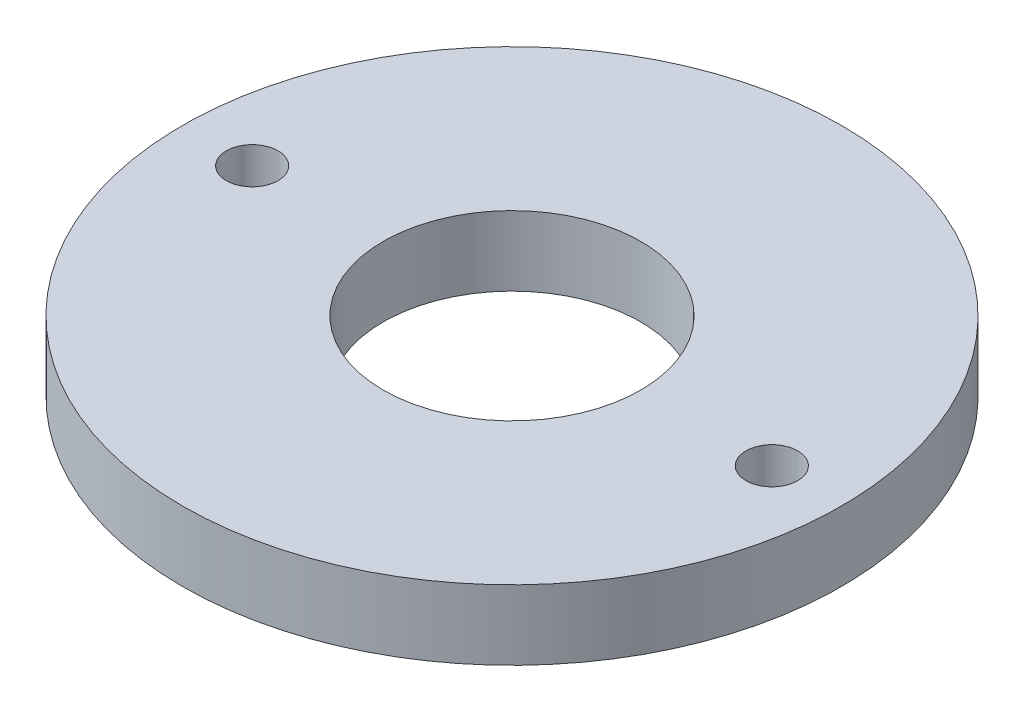
ISO-10303-21;
HEADER;
FILE_DESCRIPTION(('STEP AP214'),'2;1');
FILE_NAME('part.step','',(''),(''),'','','');
FILE_SCHEMA(('AUTOMOTIVE_DESIGN { 1 0 10303 214 1 1 1 1 }'));
ENDSEC;
DATA;
#1=APPLICATION_CONTEXT('core data for automotive mechanical design processes');
#2=APPLICATION_PROTOCOL_DEFINITION('international standard','automotive_design',2000,#1);
#3=PRODUCT_CONTEXT('',#1,'mechanical');
#4=PRODUCT('Part','Part','',(#3));
#5=PRODUCT_RELATED_PRODUCT_CATEGORY('part','',(#4));
#6=PRODUCT_DEFINITION_FORMATION('','',#4);
#7=PRODUCT_DEFINITION_CONTEXT('part definition',#1,'design');
#8=PRODUCT_DEFINITION('design','',#6,#7);
#9=PRODUCT_DEFINITION_SHAPE('','',#8);
#10=(LENGTH_UNIT() NAMED_UNIT(*) SI_UNIT(.MILLI.,.METRE.));
#11=(NAMED_UNIT(*) PLANE_ANGLE_UNIT() SI_UNIT($,.RADIAN.));
#12=(NAMED_UNIT(*) SI_UNIT($,.STERADIAN.) SOLID_ANGLE_UNIT());
#13=UNCERTAINTY_MEASURE_WITH_UNIT(LENGTH_MEASURE(1.E-05),#10,'distance_accuracy_value','');
#14=(GEOMETRIC_REPRESENTATION_CONTEXT(3) GLOBAL_UNCERTAINTY_ASSIGNED_CONTEXT((#13)) GLOBAL_UNIT_ASSIGNED_CONTEXT((#10,
#11,#12)) REPRESENTATION_CONTEXT('',''));
#15=CARTESIAN_POINT('',(0.,0.,0.));
#16=DIRECTION('',(0.,0.,1.));
#17=DIRECTION('',(1.,0.,0.));
#18=AXIS2_PLACEMENT_3D('',#15,#16,#17);
#19=CARTESIAN_POINT('',(0.,3.1,0.));
#20=DIRECTION('',(0.,1.,0.));
#21=DIRECTION('',(0.,0.,1.));
#22=AXIS2_PLACEMENT_3D('',#19,#20,#21);
#23=PLANE('',#22);
#24=CARTESIAN_POINT('',(11.55,3.1,0.));
#25=DIRECTION('',(0.,1.,0.));
#26=DIRECTION('',(0.,0.,1.));
#27=AXIS2_PLACEMENT_3D('',#24,#25,#26);
#28=CIRCLE('',#27,1.15);
#29=CARTESIAN_POINT('',(11.55,3.1,1.15));
#30=VERTEX_POINT('',#29);
#31=EDGE_CURVE('E53',#30,#30,#28,.T.);
#32=ORIENTED_EDGE('',*,*,#31,.F.);
#33=EDGE_LOOP('',(#32));
#34=FACE_BOUND('',#33,.T.);
#35=CARTESIAN_POINT('',(0.,3.1,0.));
#36=DIRECTION('',(0.,1.,0.));
#37=DIRECTION('',(0.,0.,1.));
#38=AXIS2_PLACEMENT_3D('',#35,#36,#37);
#39=CIRCLE('',#38,14.65);
#40=CARTESIAN_POINT('',(0.,3.1,14.65));
#41=VERTEX_POINT('',#40);
#42=EDGE_CURVE('E10',#41,#41,#39,.T.);
#43=ORIENTED_EDGE('',*,*,#42,.T.);
#44=EDGE_LOOP('',(#43));
#45=FACE_BOUND('',#44,.T.);
#46=CARTESIAN_POINT('',(0.,3.1,0.));
#47=DIRECTION('',(0.,1.,0.));
#48=DIRECTION('',(0.,0.,1.));
#49=AXIS2_PLACEMENT_3D('',#46,#47,#48);
#50=CIRCLE('',#49,5.725);
#51=CARTESIAN_POINT('',(0.,3.1,5.725));
#52=VERTEX_POINT('',#51);
#53=EDGE_CURVE('E48',#52,#52,#50,.T.);
#54=ORIENTED_EDGE('',*,*,#53,.F.);
#55=EDGE_LOOP('',(#54));
#56=FACE_BOUND('',#55,.T.);
#57=CARTESIAN_POINT('',(-11.55,3.1,0.));
#58=DIRECTION('',(0.,1.,0.));
#59=DIRECTION('',(0.,0.,1.));
#60=AXIS2_PLACEMENT_3D('',#57,#58,#59);
#61=CIRCLE('',#60,1.15);
#62=CARTESIAN_POINT('',(-11.55,3.1,1.15));
#63=VERTEX_POINT('',#62);
#64=EDGE_CURVE('E59',#63,#63,#61,.T.);
#65=ORIENTED_EDGE('',*,*,#64,.F.);
#66=EDGE_LOOP('',(#65));
#67=FACE_BOUND('',#66,.T.);
#68=ADVANCED_FACE('F37',(#34,#45,#56,#67),#23,.T.);
#69=CARTESIAN_POINT('',(0.,0.,0.));
#70=DIRECTION('',(0.,1.,0.));
#71=DIRECTION('',(0.,0.,1.));
#72=AXIS2_PLACEMENT_3D('',#69,#70,#71);
#73=PLANE('',#72);
#74=CARTESIAN_POINT('',(0.,0.,0.));
#75=DIRECTION('',(0.,1.,0.));
#76=DIRECTION('',(0.,0.,1.));
#77=AXIS2_PLACEMENT_3D('',#74,#75,#76);
#78=CIRCLE('',#77,14.65);
#79=CARTESIAN_POINT('',(0.,0.,14.65));
#80=VERTEX_POINT('',#79);
#81=EDGE_CURVE('E41',#80,#80,#78,.T.);
#82=ORIENTED_EDGE('',*,*,#81,.F.);
#83=EDGE_LOOP('',(#82));
#84=FACE_BOUND('',#83,.T.);
#85=CARTESIAN_POINT('',(0.,0.,0.));
#86=DIRECTION('',(0.,1.,0.));
#87=DIRECTION('',(0.,0.,1.));
#88=AXIS2_PLACEMENT_3D('',#85,#86,#87);
#89=CIRCLE('',#88,5.725);
#90=CARTESIAN_POINT('',(0.,0.,5.725));
#91=VERTEX_POINT('',#90);
#92=EDGE_CURVE('E50',#91,#91,#89,.T.);
#93=ORIENTED_EDGE('',*,*,#92,.T.);
#94=EDGE_LOOP('',(#93));
#95=FACE_BOUND('',#94,.T.);
#96=CARTESIAN_POINT('',(11.55,0.,0.));
#97=DIRECTION('',(0.,1.,0.));
#98=DIRECTION('',(0.,0.,1.));
#99=AXIS2_PLACEMENT_3D('',#96,#97,#98);
#100=CIRCLE('',#99,1.15);
#101=CARTESIAN_POINT('',(11.55,0.,1.15));
#102=VERTEX_POINT('',#101);
#103=EDGE_CURVE('E56',#102,#102,#100,.T.);
#104=ORIENTED_EDGE('',*,*,#103,.T.);
#105=EDGE_LOOP('',(#104));
#106=FACE_BOUND('',#105,.T.);
#107=CARTESIAN_POINT('',(-11.55,0.,0.));
#108=DIRECTION('',(0.,1.,0.));
#109=DIRECTION('',(0.,0.,1.));
#110=AXIS2_PLACEMENT_3D('',#107,#108,#109);
#111=CIRCLE('',#110,1.15);
#112=CARTESIAN_POINT('',(-11.55,0.,1.15));
#113=VERTEX_POINT('',#112);
#114=EDGE_CURVE('E62',#113,#113,#111,.T.);
#115=ORIENTED_EDGE('',*,*,#114,.T.);
#116=EDGE_LOOP('',(#115));
#117=FACE_BOUND('',#116,.T.);
#118=ADVANCED_FACE('F72',(#84,#95,#106,#117),#73,.F.);
#119=CARTESIAN_POINT('',(0.,3.1,0.));
#120=DIRECTION('',(0.,-1.,0.));
#121=DIRECTION('',(0.,0.,-1.));
#122=AXIS2_PLACEMENT_3D('',#119,#120,#121);
#123=CYLINDRICAL_SURFACE('',#122,14.65);
#124=ORIENTED_EDGE('',*,*,#42,.F.);
#125=EDGE_LOOP('',(#124));
#126=FACE_BOUND('',#125,.T.);
#127=ORIENTED_EDGE('',*,*,#81,.T.);
#128=EDGE_LOOP('',(#127));
#129=FACE_BOUND('',#128,.T.);
#130=ADVANCED_FACE('F39',(#126,#129),#123,.T.);
#131=CARTESIAN_POINT('',(0.,3.1,0.));
#132=DIRECTION('',(0.,-1.,0.));
#133=DIRECTION('',(0.,0.,-1.));
#134=AXIS2_PLACEMENT_3D('',#131,#132,#133);
#135=CYLINDRICAL_SURFACE('',#134,5.725);
#136=ORIENTED_EDGE('',*,*,#53,.T.);
#137=EDGE_LOOP('',(#136));
#138=FACE_BOUND('',#137,.T.);
#139=ORIENTED_EDGE('',*,*,#92,.F.);
#140=EDGE_LOOP('',(#139));
#141=FACE_BOUND('',#140,.T.);
#142=ADVANCED_FACE('F81',(#138,#141),#135,.F.);
#143=CARTESIAN_POINT('',(11.55,3.1,0.));
#144=DIRECTION('',(0.,-1.,0.));
#145=DIRECTION('',(0.,0.,-1.));
#146=AXIS2_PLACEMENT_3D('',#143,#144,#145);
#147=CYLINDRICAL_SURFACE('',#146,1.15);
#148=ORIENTED_EDGE('',*,*,#31,.T.);
#149=EDGE_LOOP('',(#148));
#150=FACE_BOUND('',#149,.T.);
#151=ORIENTED_EDGE('',*,*,#103,.F.);
#152=EDGE_LOOP('',(#151));
#153=FACE_BOUND('',#152,.T.);
#154=ADVANCED_FACE('F84',(#150,#153),#147,.F.);
#155=CARTESIAN_POINT('',(-11.55,3.1,0.));
#156=DIRECTION('',(0.,-1.,0.));
#157=DIRECTION('',(0.,0.,-1.));
#158=AXIS2_PLACEMENT_3D('',#155,#156,#157);
#159=CYLINDRICAL_SURFACE('',#158,1.15);
#160=ORIENTED_EDGE('',*,*,#64,.T.);
#161=EDGE_LOOP('',(#160));
#162=FACE_BOUND('',#161,.T.);
#163=ORIENTED_EDGE('',*,*,#114,.F.);
#164=EDGE_LOOP('',(#163));
#165=FACE_BOUND('',#164,.T.);
#166=ADVANCED_FACE('F68',(#162,#165),#159,.F.);
#167=CLOSED_SHELL('',(#68,#118,#130,#142,#154,#166));
#168=MANIFOLD_SOLID_BREP('B2',#167);
#169=ADVANCED_BREP_SHAPE_REPRESENTATION('',(#18,#168),#14);
#170=SHAPE_DEFINITION_REPRESENTATION(#9,#169);
ENDSEC;
END-ISO-10303-21;
